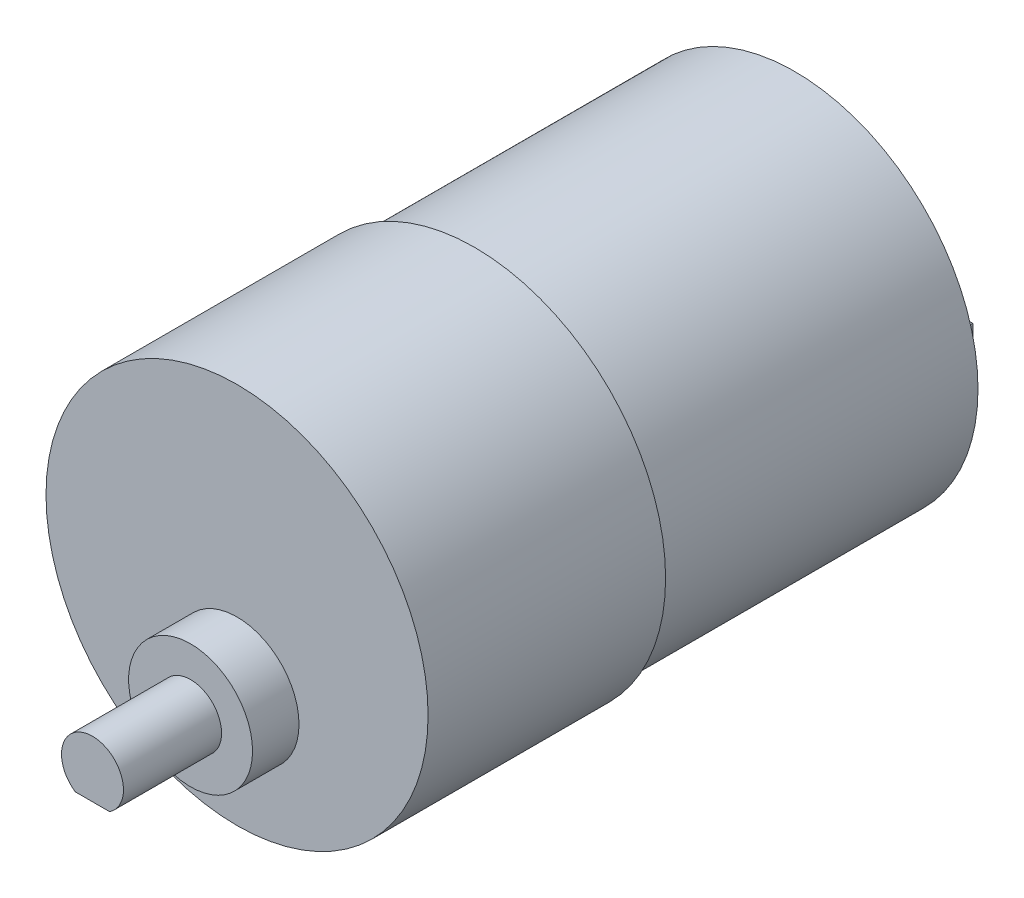
ISO-10303-21;
HEADER;
FILE_DESCRIPTION(('STEP AP214'),'2;1');
FILE_NAME('part.step','',(''),(''),'','','');
FILE_SCHEMA(('AUTOMOTIVE_DESIGN { 1 0 10303 214 1 1 1 1 }'));
ENDSEC;
DATA;
#1=APPLICATION_CONTEXT('core data for automotive mechanical design processes');
#2=APPLICATION_PROTOCOL_DEFINITION('international standard','automotive_design',2000,#1);
#3=PRODUCT_CONTEXT('',#1,'mechanical');
#4=PRODUCT('Part','Part','',(#3));
#5=PRODUCT_RELATED_PRODUCT_CATEGORY('part','',(#4));
#6=PRODUCT_DEFINITION_FORMATION('','',#4);
#7=PRODUCT_DEFINITION_CONTEXT('part definition',#1,'design');
#8=PRODUCT_DEFINITION('design','',#6,#7);
#9=PRODUCT_DEFINITION_SHAPE('','',#8);
#10=(LENGTH_UNIT() NAMED_UNIT(*) SI_UNIT(.MILLI.,.METRE.));
#11=(NAMED_UNIT(*) PLANE_ANGLE_UNIT() SI_UNIT($,.RADIAN.));
#12=(NAMED_UNIT(*) SI_UNIT($,.STERADIAN.) SOLID_ANGLE_UNIT());
#13=UNCERTAINTY_MEASURE_WITH_UNIT(LENGTH_MEASURE(1.E-05),#10,'distance_accuracy_value','');
#14=(GEOMETRIC_REPRESENTATION_CONTEXT(3) GLOBAL_UNCERTAINTY_ASSIGNED_CONTEXT((#13)) GLOBAL_UNIT_ASSIGNED_CONTEXT((#10,
#11,#12)) REPRESENTATION_CONTEXT('',''));
#15=CARTESIAN_POINT('',(0.,0.,0.));
#16=DIRECTION('',(0.,0.,1.));
#17=DIRECTION('',(1.,0.,0.));
#18=AXIS2_PLACEMENT_3D('',#15,#16,#17);
#19=CARTESIAN_POINT('',(18.4999999999999,0.,54.));
#20=DIRECTION('',(0.,0.,1.));
#21=DIRECTION('',(1.,0.,0.));
#22=AXIS2_PLACEMENT_3D('',#19,#20,#21);
#23=PLANE('',#22);
#24=CARTESIAN_POINT('',(0.,0.,54.));
#25=DIRECTION('',(0.,0.,1.));
#26=DIRECTION('',(1.,0.,0.));
#27=AXIS2_PLACEMENT_3D('',#24,#25,#26);
#28=CIRCLE('',#27,18.4999999999999);
#29=CARTESIAN_POINT('',(18.4999999999999,0.,54.));
#30=VERTEX_POINT('',#29);
#31=EDGE_CURVE('E210',#30,#30,#28,.T.);
#32=ORIENTED_EDGE('',*,*,#31,.T.);
#33=EDGE_LOOP('',(#32));
#34=FACE_BOUND('',#33,.T.);
#35=CARTESIAN_POINT('',(0.,-7.,54.));
#36=DIRECTION('',(0.,0.,1.));
#37=DIRECTION('',(1.,0.,0.));
#38=AXIS2_PLACEMENT_3D('',#35,#36,#37);
#39=CIRCLE('',#38,6.);
#40=CARTESIAN_POINT('',(6.,-7.,54.));
#41=VERTEX_POINT('',#40);
#42=EDGE_CURVE('E150',#41,#41,#39,.T.);
#43=ORIENTED_EDGE('',*,*,#42,.F.);
#44=EDGE_LOOP('',(#43));
#45=FACE_BOUND('',#44,.T.);
#46=ADVANCED_FACE('F47',(#34,#45),#23,.T.);
#47=CARTESIAN_POINT('',(0.,0.,0.));
#48=DIRECTION('',(0.,0.,-1.));
#49=DIRECTION('',(-1.,0.,0.));
#50=AXIS2_PLACEMENT_3D('',#47,#48,#49);
#51=PLANE('',#50);
#52=CARTESIAN_POINT('',(0.,0.,0.));
#53=DIRECTION('',(0.,0.,1.));
#54=DIRECTION('',(1.,0.,0.));
#55=AXIS2_PLACEMENT_3D('',#52,#53,#54);
#56=CIRCLE('',#55,17.75);
#57=CARTESIAN_POINT('',(17.75,0.,0.));
#58=VERTEX_POINT('',#57);
#59=EDGE_CURVE('E11',#58,#58,#56,.T.);
#60=ORIENTED_EDGE('',*,*,#59,.F.);
#61=EDGE_LOOP('',(#60));
#62=FACE_BOUND('',#61,.T.);
#63=DIRECTION('',(1.,0.,0.));
#64=VECTOR('',#63,1.);
#65=CARTESIAN_POINT('',(13.25,1.25,0.));
#66=LINE('',#65,#64);
#67=CARTESIAN_POINT('',(11.75,1.25,0.));
#68=VERTEX_POINT('',#67);
#69=CARTESIAN_POINT('',(13.25,1.25,0.));
#70=VERTEX_POINT('',#69);
#71=EDGE_CURVE('E197',#68,#70,#66,.T.);
#72=ORIENTED_EDGE('',*,*,#71,.F.);
#73=DIRECTION('',(0.,1.,0.));
#74=VECTOR('',#73,1.);
#75=CARTESIAN_POINT('',(11.75,-1.25,0.));
#76=LINE('',#75,#74);
#77=CARTESIAN_POINT('',(11.75,-1.25,0.));
#78=VERTEX_POINT('',#77);
#79=EDGE_CURVE('E176',#78,#68,#76,.T.);
#80=ORIENTED_EDGE('',*,*,#79,.F.);
#81=DIRECTION('',(-1.,0.,0.));
#82=VECTOR('',#81,1.);
#83=CARTESIAN_POINT('',(13.25,-1.25,0.));
#84=LINE('',#83,#82);
#85=CARTESIAN_POINT('',(13.25,-1.25,0.));
#86=VERTEX_POINT('',#85);
#87=EDGE_CURVE('E188',#86,#78,#84,.T.);
#88=ORIENTED_EDGE('',*,*,#87,.F.);
#89=DIRECTION('',(0.,-1.,0.));
#90=VECTOR('',#89,1.);
#91=CARTESIAN_POINT('',(13.25,-1.25,0.));
#92=LINE('',#91,#90);
#93=EDGE_CURVE('E199',#70,#86,#92,.T.);
#94=ORIENTED_EDGE('',*,*,#93,.F.);
#95=EDGE_LOOP('',(#72,#80,#88,#94));
#96=FACE_BOUND('',#95,.T.);
#97=DIRECTION('',(1.,0.,0.));
#98=VECTOR('',#97,1.);
#99=CARTESIAN_POINT('',(-11.75,1.25,0.));
#100=LINE('',#99,#98);
#101=CARTESIAN_POINT('',(-13.25,1.25,0.));
#102=VERTEX_POINT('',#101);
#103=CARTESIAN_POINT('',(-11.75,1.25,0.));
#104=VERTEX_POINT('',#103);
#105=EDGE_CURVE('E171',#102,#104,#100,.T.);
#106=ORIENTED_EDGE('',*,*,#105,.F.);
#107=DIRECTION('',(0.,1.,0.));
#108=VECTOR('',#107,1.);
#109=CARTESIAN_POINT('',(-13.25,-1.25,0.));
#110=LINE('',#109,#108);
#111=CARTESIAN_POINT('',(-13.25,-1.25,0.));
#112=VERTEX_POINT('',#111);
#113=EDGE_CURVE('E173',#112,#102,#110,.T.);
#114=ORIENTED_EDGE('',*,*,#113,.F.);
#115=DIRECTION('',(-1.,0.,0.));
#116=VECTOR('',#115,1.);
#117=CARTESIAN_POINT('',(-11.75,-1.25,0.));
#118=LINE('',#117,#116);
#119=CARTESIAN_POINT('',(-11.75,-1.25,0.));
#120=VERTEX_POINT('',#119);
#121=EDGE_CURVE('E166',#120,#112,#118,.T.);
#122=ORIENTED_EDGE('',*,*,#121,.F.);
#123=DIRECTION('',(0.,-1.,0.));
#124=VECTOR('',#123,1.);
#125=CARTESIAN_POINT('',(-11.75,-1.25,0.));
#126=LINE('',#125,#124);
#127=EDGE_CURVE('E168',#104,#120,#126,.T.);
#128=ORIENTED_EDGE('',*,*,#127,.F.);
#129=EDGE_LOOP('',(#106,#114,#122,#128));
#130=FACE_BOUND('',#129,.T.);
#131=ADVANCED_FACE('F49',(#62,#96,#130),#51,.T.);
#132=CARTESIAN_POINT('',(0.,0.,54.));
#133=DIRECTION('',(0.,0.,1.));
#134=DIRECTION('',(1.,0.,0.));
#135=AXIS2_PLACEMENT_3D('',#132,#133,#134);
#136=CYLINDRICAL_SURFACE('',#135,17.75);
#137=ORIENTED_EDGE('',*,*,#59,.T.);
#138=EDGE_LOOP('',(#137));
#139=FACE_BOUND('',#138,.T.);
#140=CARTESIAN_POINT('',(0.,0.,31.));
#141=DIRECTION('',(0.,0.,1.));
#142=DIRECTION('',(1.,0.,0.));
#143=AXIS2_PLACEMENT_3D('',#140,#141,#142);
#144=CIRCLE('',#143,17.75);
#145=CARTESIAN_POINT('',(17.75,0.,31.));
#146=VERTEX_POINT('',#145);
#147=EDGE_CURVE('E55',#146,#146,#144,.T.);
#148=ORIENTED_EDGE('',*,*,#147,.F.);
#149=EDGE_LOOP('',(#148));
#150=FACE_BOUND('',#149,.T.);
#151=ADVANCED_FACE('F221',(#139,#150),#136,.T.);
#152=CARTESIAN_POINT('',(17.75,0.,31.));
#153=DIRECTION('',(0.,0.,-1.));
#154=DIRECTION('',(-1.,0.,0.));
#155=AXIS2_PLACEMENT_3D('',#152,#153,#154);
#156=PLANE('',#155);
#157=ORIENTED_EDGE('',*,*,#147,.T.);
#158=EDGE_LOOP('',(#157));
#159=FACE_BOUND('',#158,.T.);
#160=CARTESIAN_POINT('',(0.,0.,31.));
#161=DIRECTION('',(0.,0.,1.));
#162=DIRECTION('',(1.,0.,0.));
#163=AXIS2_PLACEMENT_3D('',#160,#161,#162);
#164=CIRCLE('',#163,18.4999999999999);
#165=CARTESIAN_POINT('',(18.4999999999999,0.,31.));
#166=VERTEX_POINT('',#165);
#167=EDGE_CURVE('E213',#166,#166,#164,.T.);
#168=ORIENTED_EDGE('',*,*,#167,.F.);
#169=EDGE_LOOP('',(#168));
#170=FACE_BOUND('',#169,.T.);
#171=ADVANCED_FACE('F218',(#159,#170),#156,.T.);
#172=CARTESIAN_POINT('',(0.,0.,54.));
#173=DIRECTION('',(0.,0.,1.));
#174=DIRECTION('',(1.,0.,0.));
#175=AXIS2_PLACEMENT_3D('',#172,#173,#174);
#176=CYLINDRICAL_SURFACE('',#175,18.4999999999999);
#177=ORIENTED_EDGE('',*,*,#167,.T.);
#178=EDGE_LOOP('',(#177));
#179=FACE_BOUND('',#178,.T.);
#180=ORIENTED_EDGE('',*,*,#31,.F.);
#181=EDGE_LOOP('',(#180));
#182=FACE_BOUND('',#181,.T.);
#183=ADVANCED_FACE('F228',(#179,#182),#176,.T.);
#184=CARTESIAN_POINT('',(11.75,-1.25,-4.));
#185=DIRECTION('',(1.,0.,0.));
#186=DIRECTION('',(0.,0.,-1.));
#187=AXIS2_PLACEMENT_3D('',#184,#185,#186);
#188=PLANE('',#187);
#189=ORIENTED_EDGE('',*,*,#79,.T.);
#190=DIRECTION('',(0.,0.,1.));
#191=VECTOR('',#190,1.);
#192=CARTESIAN_POINT('',(11.75,1.25,-4.));
#193=LINE('',#192,#191);
#194=CARTESIAN_POINT('',(11.75,1.25,-4.));
#195=VERTEX_POINT('',#194);
#196=EDGE_CURVE('E208',#195,#68,#193,.T.);
#197=ORIENTED_EDGE('',*,*,#196,.F.);
#198=DIRECTION('',(0.,1.,0.));
#199=VECTOR('',#198,1.);
#200=CARTESIAN_POINT('',(11.75,-1.25,-4.));
#201=LINE('',#200,#199);
#202=CARTESIAN_POINT('',(11.75,-1.25,-4.));
#203=VERTEX_POINT('',#202);
#204=EDGE_CURVE('E184',#203,#195,#201,.T.);
#205=ORIENTED_EDGE('',*,*,#204,.F.);
#206=DIRECTION('',(0.,0.,1.));
#207=VECTOR('',#206,1.);
#208=CARTESIAN_POINT('',(11.75,-1.25,-4.));
#209=LINE('',#208,#207);
#210=EDGE_CURVE('E194',#203,#78,#209,.T.);
#211=ORIENTED_EDGE('',*,*,#210,.T.);
#212=EDGE_LOOP('',(#189,#197,#205,#211));
#213=FACE_BOUND('',#212,.T.);
#214=ADVANCED_FACE('F239',(#213),#188,.F.);
#215=CARTESIAN_POINT('',(13.25,1.25,-4.));
#216=DIRECTION('',(0.,-1.,0.));
#217=DIRECTION('',(0.,0.,-1.));
#218=AXIS2_PLACEMENT_3D('',#215,#216,#217);
#219=PLANE('',#218);
#220=ORIENTED_EDGE('',*,*,#71,.T.);
#221=DIRECTION('',(0.,0.,1.));
#222=VECTOR('',#221,1.);
#223=CARTESIAN_POINT('',(13.25,1.25,-4.));
#224=LINE('',#223,#222);
#225=CARTESIAN_POINT('',(13.25,1.25,-4.));
#226=VERTEX_POINT('',#225);
#227=EDGE_CURVE('E205',#226,#70,#224,.T.);
#228=ORIENTED_EDGE('',*,*,#227,.F.);
#229=DIRECTION('',(1.,0.,0.));
#230=VECTOR('',#229,1.);
#231=CARTESIAN_POINT('',(13.25,1.25,-4.));
#232=LINE('',#231,#230);
#233=EDGE_CURVE('E187',#195,#226,#232,.T.);
#234=ORIENTED_EDGE('',*,*,#233,.F.);
#235=ORIENTED_EDGE('',*,*,#196,.T.);
#236=EDGE_LOOP('',(#220,#228,#234,#235));
#237=FACE_BOUND('',#236,.T.);
#238=ADVANCED_FACE('F246',(#237),#219,.F.);
#239=CARTESIAN_POINT('',(13.25,-1.25,-4.));
#240=DIRECTION('',(-1.,0.,0.));
#241=DIRECTION('',(0.,0.,1.));
#242=AXIS2_PLACEMENT_3D('',#239,#240,#241);
#243=PLANE('',#242);
#244=ORIENTED_EDGE('',*,*,#93,.T.);
#245=DIRECTION('',(0.,0.,1.));
#246=VECTOR('',#245,1.);
#247=CARTESIAN_POINT('',(13.25,-1.25,-4.));
#248=LINE('',#247,#246);
#249=CARTESIAN_POINT('',(13.25,-1.25,-4.));
#250=VERTEX_POINT('',#249);
#251=EDGE_CURVE('E70',#250,#86,#248,.T.);
#252=ORIENTED_EDGE('',*,*,#251,.F.);
#253=DIRECTION('',(0.,-1.,0.));
#254=VECTOR('',#253,1.);
#255=CARTESIAN_POINT('',(13.25,-1.25,-4.));
#256=LINE('',#255,#254);
#257=EDGE_CURVE('E190',#226,#250,#256,.T.);
#258=ORIENTED_EDGE('',*,*,#257,.F.);
#259=ORIENTED_EDGE('',*,*,#227,.T.);
#260=EDGE_LOOP('',(#244,#252,#258,#259));
#261=FACE_BOUND('',#260,.T.);
#262=ADVANCED_FACE('F254',(#261),#243,.F.);
#263=CARTESIAN_POINT('',(13.25,-1.25,-4.));
#264=DIRECTION('',(0.,1.,0.));
#265=DIRECTION('',(0.,0.,1.));
#266=AXIS2_PLACEMENT_3D('',#263,#264,#265);
#267=PLANE('',#266);
#268=ORIENTED_EDGE('',*,*,#87,.T.);
#269=ORIENTED_EDGE('',*,*,#210,.F.);
#270=DIRECTION('',(-1.,0.,0.));
#271=VECTOR('',#270,1.);
#272=CARTESIAN_POINT('',(13.25,-1.25,-4.));
#273=LINE('',#272,#271);
#274=EDGE_CURVE('E192',#250,#203,#273,.T.);
#275=ORIENTED_EDGE('',*,*,#274,.F.);
#276=ORIENTED_EDGE('',*,*,#251,.T.);
#277=EDGE_LOOP('',(#268,#269,#275,#276));
#278=FACE_BOUND('',#277,.T.);
#279=ADVANCED_FACE('F270',(#278),#267,.F.);
#280=CARTESIAN_POINT('',(0.,0.,-4.));
#281=DIRECTION('',(0.,0.,1.));
#282=DIRECTION('',(1.,0.,0.));
#283=AXIS2_PLACEMENT_3D('',#280,#281,#282);
#284=PLANE('',#283);
#285=ORIENTED_EDGE('',*,*,#204,.T.);
#286=ORIENTED_EDGE('',*,*,#233,.T.);
#287=ORIENTED_EDGE('',*,*,#257,.T.);
#288=ORIENTED_EDGE('',*,*,#274,.T.);
#289=EDGE_LOOP('',(#285,#286,#287,#288));
#290=FACE_BOUND('',#289,.T.);
#291=ADVANCED_FACE('F269',(#290),#284,.F.);
#292=CARTESIAN_POINT('',(-13.25,-1.25,-4.));
#293=DIRECTION('',(1.,0.,0.));
#294=DIRECTION('',(0.,0.,-1.));
#295=AXIS2_PLACEMENT_3D('',#292,#293,#294);
#296=PLANE('',#295);
#297=ORIENTED_EDGE('',*,*,#113,.T.);
#298=DIRECTION('',(0.,0.,1.));
#299=VECTOR('',#298,1.);
#300=CARTESIAN_POINT('',(-13.25,1.25,-4.));
#301=LINE('',#300,#299);
#302=CARTESIAN_POINT('',(-13.25,1.25,-4.));
#303=VERTEX_POINT('',#302);
#304=EDGE_CURVE('E154',#303,#102,#301,.T.);
#305=ORIENTED_EDGE('',*,*,#304,.F.);
#306=DIRECTION('',(0.,1.,0.));
#307=VECTOR('',#306,1.);
#308=CARTESIAN_POINT('',(-13.25,-1.25,-4.));
#309=LINE('',#308,#307);
#310=CARTESIAN_POINT('',(-13.25,-1.25,-4.));
#311=VERTEX_POINT('',#310);
#312=EDGE_CURVE('E169',#311,#303,#309,.T.);
#313=ORIENTED_EDGE('',*,*,#312,.F.);
#314=DIRECTION('',(0.,0.,1.));
#315=VECTOR('',#314,1.);
#316=CARTESIAN_POINT('',(-13.25,-1.25,-4.));
#317=LINE('',#316,#315);
#318=EDGE_CURVE('E162',#311,#112,#317,.T.);
#319=ORIENTED_EDGE('',*,*,#318,.T.);
#320=EDGE_LOOP('',(#297,#305,#313,#319));
#321=FACE_BOUND('',#320,.T.);
#322=ADVANCED_FACE('F277',(#321),#296,.F.);
#323=CARTESIAN_POINT('',(-11.75,1.25,-4.));
#324=DIRECTION('',(0.,-1.,0.));
#325=DIRECTION('',(0.,0.,-1.));
#326=AXIS2_PLACEMENT_3D('',#323,#324,#325);
#327=PLANE('',#326);
#328=ORIENTED_EDGE('',*,*,#105,.T.);
#329=DIRECTION('',(0.,0.,1.));
#330=VECTOR('',#329,1.);
#331=CARTESIAN_POINT('',(-11.75,1.25,-4.));
#332=LINE('',#331,#330);
#333=CARTESIAN_POINT('',(-11.75,1.25,-4.));
#334=VERTEX_POINT('',#333);
#335=EDGE_CURVE('E158',#334,#104,#332,.T.);
#336=ORIENTED_EDGE('',*,*,#335,.F.);
#337=DIRECTION('',(1.,0.,0.));
#338=VECTOR('',#337,1.);
#339=CARTESIAN_POINT('',(-11.75,1.25,-4.));
#340=LINE('',#339,#338);
#341=EDGE_CURVE('E180',#303,#334,#340,.T.);
#342=ORIENTED_EDGE('',*,*,#341,.F.);
#343=ORIENTED_EDGE('',*,*,#304,.T.);
#344=EDGE_LOOP('',(#328,#336,#342,#343));
#345=FACE_BOUND('',#344,.T.);
#346=ADVANCED_FACE('F292',(#345),#327,.F.);
#347=CARTESIAN_POINT('',(-11.75,-1.25,-4.));
#348=DIRECTION('',(-1.,0.,0.));
#349=DIRECTION('',(0.,0.,1.));
#350=AXIS2_PLACEMENT_3D('',#347,#348,#349);
#351=PLANE('',#350);
#352=ORIENTED_EDGE('',*,*,#127,.T.);
#353=DIRECTION('',(0.,0.,1.));
#354=VECTOR('',#353,1.);
#355=CARTESIAN_POINT('',(-11.75,-1.25,-4.));
#356=LINE('',#355,#354);
#357=CARTESIAN_POINT('',(-11.75,-1.25,-4.));
#358=VERTEX_POINT('',#357);
#359=EDGE_CURVE('E62',#358,#120,#356,.T.);
#360=ORIENTED_EDGE('',*,*,#359,.F.);
#361=DIRECTION('',(0.,-1.,0.));
#362=VECTOR('',#361,1.);
#363=CARTESIAN_POINT('',(-11.75,-1.25,-4.));
#364=LINE('',#363,#362);
#365=EDGE_CURVE('E178',#334,#358,#364,.T.);
#366=ORIENTED_EDGE('',*,*,#365,.F.);
#367=ORIENTED_EDGE('',*,*,#335,.T.);
#368=EDGE_LOOP('',(#352,#360,#366,#367));
#369=FACE_BOUND('',#368,.T.);
#370=ADVANCED_FACE('F289',(#369),#351,.F.);
#371=CARTESIAN_POINT('',(-11.75,-1.25,-4.));
#372=DIRECTION('',(0.,1.,0.));
#373=DIRECTION('',(0.,0.,1.));
#374=AXIS2_PLACEMENT_3D('',#371,#372,#373);
#375=PLANE('',#374);
#376=ORIENTED_EDGE('',*,*,#121,.T.);
#377=ORIENTED_EDGE('',*,*,#318,.F.);
#378=DIRECTION('',(-1.,0.,0.));
#379=VECTOR('',#378,1.);
#380=CARTESIAN_POINT('',(-11.75,-1.25,-4.));
#381=LINE('',#380,#379);
#382=EDGE_CURVE('E165',#358,#311,#381,.T.);
#383=ORIENTED_EDGE('',*,*,#382,.F.);
#384=ORIENTED_EDGE('',*,*,#359,.T.);
#385=EDGE_LOOP('',(#376,#377,#383,#384));
#386=FACE_BOUND('',#385,.T.);
#387=ADVANCED_FACE('F285',(#386),#375,.F.);
#388=CARTESIAN_POINT('',(0.,0.,-4.));
#389=DIRECTION('',(0.,0.,1.));
#390=DIRECTION('',(1.,0.,0.));
#391=AXIS2_PLACEMENT_3D('',#388,#389,#390);
#392=PLANE('',#391);
#393=ORIENTED_EDGE('',*,*,#312,.T.);
#394=ORIENTED_EDGE('',*,*,#341,.T.);
#395=ORIENTED_EDGE('',*,*,#365,.T.);
#396=ORIENTED_EDGE('',*,*,#382,.T.);
#397=EDGE_LOOP('',(#393,#394,#395,#396));
#398=FACE_BOUND('',#397,.T.);
#399=ADVANCED_FACE('F281',(#398),#392,.F.);
#400=CARTESIAN_POINT('',(0.,-7.,58.5));
#401=DIRECTION('',(0.,0.,1.));
#402=DIRECTION('',(1.,0.,0.));
#403=AXIS2_PLACEMENT_3D('',#400,#401,#402);
#404=PLANE('',#403);
#405=CARTESIAN_POINT('',(0.,-7.,58.5));
#406=DIRECTION('',(0.,0.,1.));
#407=DIRECTION('',(1.,0.,0.));
#408=AXIS2_PLACEMENT_3D('',#405,#406,#407);
#409=CIRCLE('',#408,6.);
#410=CARTESIAN_POINT('',(6.,-7.,58.5));
#411=VERTEX_POINT('',#410);
#412=EDGE_CURVE('E151',#411,#411,#409,.T.);
#413=ORIENTED_EDGE('',*,*,#412,.T.);
#414=EDGE_LOOP('',(#413));
#415=FACE_BOUND('',#414,.T.);
#416=DIRECTION('',(1.,0.,0.));
#417=VECTOR('',#416,1.);
#418=CARTESIAN_POINT('',(-1.6583123951777,-9.5,58.5));
#419=LINE('',#418,#417);
#420=CARTESIAN_POINT('',(-1.6583123951777,-9.5,58.5));
#421=VERTEX_POINT('',#420);
#422=CARTESIAN_POINT('',(1.6583123951777,-9.5,58.5));
#423=VERTEX_POINT('',#422);
#424=EDGE_CURVE('E143',#421,#423,#419,.T.);
#425=ORIENTED_EDGE('',*,*,#424,.F.);
#426=CARTESIAN_POINT('',(0.,-7.,58.5));
#427=DIRECTION('',(0.,0.,1.));
#428=DIRECTION('',(1.,0.,0.));
#429=AXIS2_PLACEMENT_3D('',#426,#427,#428);
#430=CIRCLE('',#429,3.);
#431=EDGE_CURVE('E144',#423,#421,#430,.T.);
#432=ORIENTED_EDGE('',*,*,#431,.F.);
#433=EDGE_LOOP('',(#425,#432));
#434=FACE_BOUND('',#433,.T.);
#435=ADVANCED_FACE('F284',(#415,#434),#404,.T.);
#436=CARTESIAN_POINT('',(0.,-7.,58.5));
#437=DIRECTION('',(0.,0.,-1.));
#438=DIRECTION('',(-1.,0.,0.));
#439=AXIS2_PLACEMENT_3D('',#436,#437,#438);
#440=CYLINDRICAL_SURFACE('',#439,6.);
#441=ORIENTED_EDGE('',*,*,#412,.F.);
#442=EDGE_LOOP('',(#441));
#443=FACE_BOUND('',#442,.T.);
#444=ORIENTED_EDGE('',*,*,#42,.T.);
#445=EDGE_LOOP('',(#444));
#446=FACE_BOUND('',#445,.T.);
#447=ADVANCED_FACE('F300',(#443,#446),#440,.T.);
#448=CARTESIAN_POINT('',(0.,-9.5,68.));
#449=DIRECTION('',(0.,1.,0.));
#450=DIRECTION('',(0.,0.,1.));
#451=AXIS2_PLACEMENT_3D('',#448,#449,#450);
#452=PLANE('',#451);
#453=ORIENTED_EDGE('',*,*,#424,.T.);
#454=DIRECTION('',(0.,0.,-1.));
#455=VECTOR('',#454,1.);
#456=CARTESIAN_POINT('',(1.6583123951777,-9.5,68.));
#457=LINE('',#456,#455);
#458=CARTESIAN_POINT('',(1.6583123951777,-9.5,68.));
#459=VERTEX_POINT('',#458);
#460=EDGE_CURVE('E131',#459,#423,#457,.T.);
#461=ORIENTED_EDGE('',*,*,#460,.F.);
#462=DIRECTION('',(1.,0.,0.));
#463=VECTOR('',#462,1.);
#464=CARTESIAN_POINT('',(0.,-9.5,68.));
#465=LINE('',#464,#463);
#466=CARTESIAN_POINT('',(-1.6583123951777,-9.5,68.));
#467=VERTEX_POINT('',#466);
#468=EDGE_CURVE('E136',#467,#459,#465,.T.);
#469=ORIENTED_EDGE('',*,*,#468,.F.);
#470=DIRECTION('',(0.,0.,-1.));
#471=VECTOR('',#470,1.);
#472=CARTESIAN_POINT('',(-1.6583123951777,-9.5,68.));
#473=LINE('',#472,#471);
#474=EDGE_CURVE('E133',#467,#421,#473,.T.);
#475=ORIENTED_EDGE('',*,*,#474,.T.);
#476=EDGE_LOOP('',(#453,#461,#469,#475));
#477=FACE_BOUND('',#476,.T.);
#478=ADVANCED_FACE('F142',(#477),#452,.F.);
#479=CARTESIAN_POINT('',(0.,-7.,68.));
#480=DIRECTION('',(0.,0.,-1.));
#481=DIRECTION('',(-1.,0.,0.));
#482=AXIS2_PLACEMENT_3D('',#479,#480,#481);
#483=CYLINDRICAL_SURFACE('',#482,3.);
#484=ORIENTED_EDGE('',*,*,#431,.T.);
#485=ORIENTED_EDGE('',*,*,#474,.F.);
#486=CARTESIAN_POINT('',(0.,-7.,68.));
#487=DIRECTION('',(0.,0.,1.));
#488=DIRECTION('',(1.,0.,0.));
#489=AXIS2_PLACEMENT_3D('',#486,#487,#488);
#490=CIRCLE('',#489,3.);
#491=EDGE_CURVE('E126',#459,#467,#490,.T.);
#492=ORIENTED_EDGE('',*,*,#491,.F.);
#493=ORIENTED_EDGE('',*,*,#460,.T.);
#494=EDGE_LOOP('',(#484,#485,#492,#493));
#495=FACE_BOUND('',#494,.T.);
#496=ADVANCED_FACE('F129',(#495),#483,.T.);
#497=CARTESIAN_POINT('',(0.,0.,68.));
#498=DIRECTION('',(0.,0.,1.));
#499=DIRECTION('',(1.,0.,0.));
#500=AXIS2_PLACEMENT_3D('',#497,#498,#499);
#501=PLANE('',#500);
#502=ORIENTED_EDGE('',*,*,#468,.T.);
#503=ORIENTED_EDGE('',*,*,#491,.T.);
#504=EDGE_LOOP('',(#502,#503));
#505=FACE_BOUND('',#504,.T.);
#506=ADVANCED_FACE('F138',(#505),#501,.T.);
#507=CLOSED_SHELL('',(#46,#131,#151,#171,#183,#214,#238,#262,#279,#291,#322,#346,#370,#387,#399,
#435,#447,#478,#496,#506));
#508=MANIFOLD_SOLID_BREP('B2',#507);
#509=ADVANCED_BREP_SHAPE_REPRESENTATION('',(#18,#508),#14);
#510=SHAPE_DEFINITION_REPRESENTATION(#9,#509);
ENDSEC;
END-ISO-10303-21;
